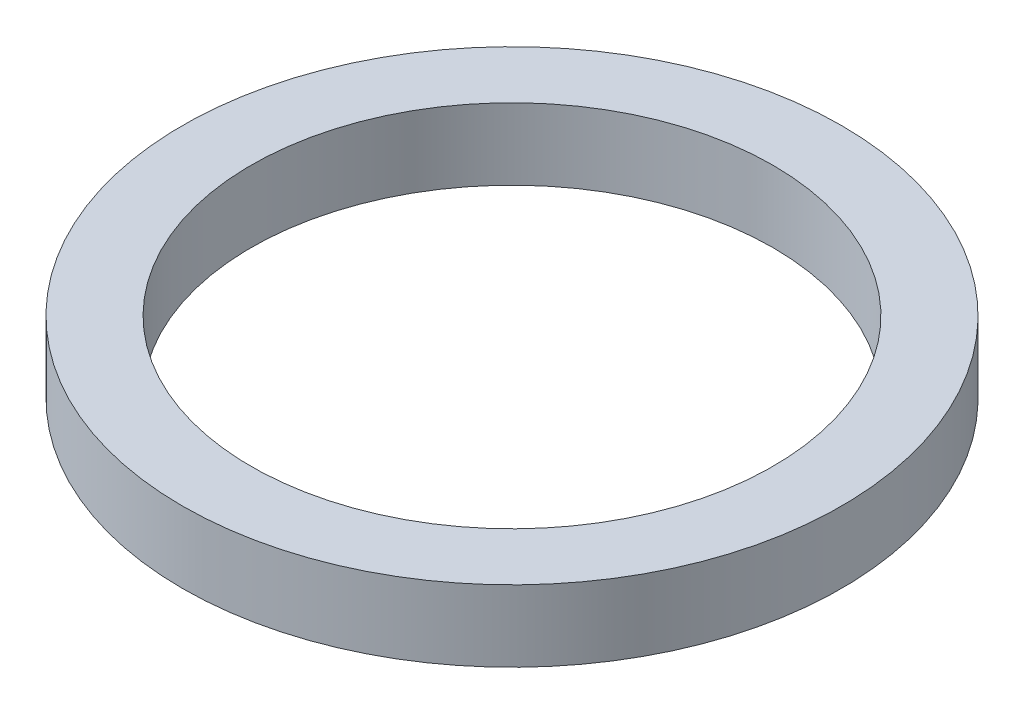
ISO-10303-21;
HEADER;
FILE_DESCRIPTION(('STEP AP214'),'2;1');
FILE_NAME('part.step','',(''),(''),'','','');
FILE_SCHEMA(('AUTOMOTIVE_DESIGN { 1 0 10303 214 1 1 1 1 }'));
ENDSEC;
DATA;
#1=APPLICATION_CONTEXT('core data for automotive mechanical design processes');
#2=APPLICATION_PROTOCOL_DEFINITION('international standard','automotive_design',2000,#1);
#3=PRODUCT_CONTEXT('',#1,'mechanical');
#4=PRODUCT('Part','Part','',(#3));
#5=PRODUCT_RELATED_PRODUCT_CATEGORY('part','',(#4));
#6=PRODUCT_DEFINITION_FORMATION('','',#4);
#7=PRODUCT_DEFINITION_CONTEXT('part definition',#1,'design');
#8=PRODUCT_DEFINITION('design','',#6,#7);
#9=PRODUCT_DEFINITION_SHAPE('','',#8);
#10=(LENGTH_UNIT() NAMED_UNIT(*) SI_UNIT(.MILLI.,.METRE.));
#11=(NAMED_UNIT(*) PLANE_ANGLE_UNIT() SI_UNIT($,.RADIAN.));
#12=(NAMED_UNIT(*) SI_UNIT($,.STERADIAN.) SOLID_ANGLE_UNIT());
#13=UNCERTAINTY_MEASURE_WITH_UNIT(LENGTH_MEASURE(1.E-05),#10,'distance_accuracy_value','');
#14=(GEOMETRIC_REPRESENTATION_CONTEXT(3) GLOBAL_UNCERTAINTY_ASSIGNED_CONTEXT((#13)) GLOBAL_UNIT_ASSIGNED_CONTEXT((#10,
#11,#12)) REPRESENTATION_CONTEXT('',''));
#15=CARTESIAN_POINT('',(0.,0.,0.));
#16=DIRECTION('',(0.,0.,1.));
#17=DIRECTION('',(1.,0.,0.));
#18=AXIS2_PLACEMENT_3D('',#15,#16,#17);
#19=CARTESIAN_POINT('',(0.,13.,0.));
#20=DIRECTION('',(0.,-1.,0.));
#21=DIRECTION('',(0.,0.,-1.));
#22=AXIS2_PLACEMENT_3D('',#19,#20,#21);
#23=CYLINDRICAL_SURFACE('',#22,60.);
#24=CARTESIAN_POINT('',(0.,13.,0.));
#25=DIRECTION('',(0.,1.,0.));
#26=DIRECTION('',(0.,0.,1.));
#27=AXIS2_PLACEMENT_3D('',#24,#25,#26);
#28=CIRCLE('',#27,60.);
#29=CARTESIAN_POINT('',(0.,13.,-60.));
#30=VERTEX_POINT('',#29);
#31=EDGE_CURVE('E10',#30,#30,#28,.T.);
#32=CARTESIAN_POINT('',(0.,0.,0.));
#33=DIRECTION('',(0.,1.,0.));
#34=DIRECTION('',(0.,0.,1.));
#35=AXIS2_PLACEMENT_3D('',#32,#33,#34);
#36=CIRCLE('',#35,60.);
#37=CARTESIAN_POINT('',(0.,0.,-60.));
#38=VERTEX_POINT('',#37);
#39=EDGE_CURVE('E37',#38,#38,#36,.T.);
#40=CARTESIAN_POINT('',(0.,13.,-60.));
#41=CARTESIAN_POINT('',(0.,12.8645833333333,-60.));
#42=CARTESIAN_POINT('',(0.,12.7291666666667,-60.));
#43=CARTESIAN_POINT('',(0.,12.4583333333333,-60.));
#44=CARTESIAN_POINT('',(0.,12.3229166666667,-60.));
#45=CARTESIAN_POINT('',(0.,12.0520833333333,-60.));
#46=CARTESIAN_POINT('',(0.,11.9166666666667,-60.));
#47=CARTESIAN_POINT('',(0.,11.6458333333333,-60.));
#48=CARTESIAN_POINT('',(0.,11.5104166666667,-60.));
#49=CARTESIAN_POINT('',(0.,11.2395833333333,-60.));
#50=CARTESIAN_POINT('',(0.,11.1041666666667,-60.));
#51=CARTESIAN_POINT('',(0.,10.8333333333333,-60.));
#52=CARTESIAN_POINT('',(0.,10.6979166666667,-60.));
#53=CARTESIAN_POINT('',(0.,10.4270833333333,-60.));
#54=CARTESIAN_POINT('',(0.,10.2916666666667,-60.));
#55=CARTESIAN_POINT('',(0.,10.0208333333333,-60.));
#56=CARTESIAN_POINT('',(0.,9.88541666666667,-60.));
#57=CARTESIAN_POINT('',(0.,9.61458333333333,-60.));
#58=CARTESIAN_POINT('',(0.,9.47916666666667,-60.));
#59=CARTESIAN_POINT('',(0.,9.20833333333333,-60.));
#60=CARTESIAN_POINT('',(0.,9.07291666666666,-60.));
#61=CARTESIAN_POINT('',(0.,8.80208333333333,-60.));
#62=CARTESIAN_POINT('',(0.,8.66666666666667,-60.));
#63=CARTESIAN_POINT('',(0.,8.39583333333333,-60.));
#64=CARTESIAN_POINT('',(0.,8.26041666666667,-60.));
#65=CARTESIAN_POINT('',(0.,7.98958333333333,-60.));
#66=CARTESIAN_POINT('',(0.,7.85416666666667,-60.));
#67=CARTESIAN_POINT('',(0.,7.58333333333333,-60.));
#68=CARTESIAN_POINT('',(0.,7.44791666666667,-60.));
#69=CARTESIAN_POINT('',(0.,7.17708333333333,-60.));
#70=CARTESIAN_POINT('',(0.,7.04166666666667,-60.));
#71=CARTESIAN_POINT('',(0.,6.77083333333333,-60.));
#72=CARTESIAN_POINT('',(0.,6.63541666666667,-60.));
#73=CARTESIAN_POINT('',(0.,6.36458333333333,-60.));
#74=CARTESIAN_POINT('',(0.,6.22916666666667,-60.));
#75=CARTESIAN_POINT('',(0.,5.95833333333333,-60.));
#76=CARTESIAN_POINT('',(0.,5.82291666666667,-60.));
#77=CARTESIAN_POINT('',(0.,5.55208333333333,-60.));
#78=CARTESIAN_POINT('',(0.,5.41666666666667,-60.));
#79=CARTESIAN_POINT('',(0.,5.14583333333333,-60.));
#80=CARTESIAN_POINT('',(0.,5.01041666666667,-60.));
#81=CARTESIAN_POINT('',(0.,4.73958333333333,-60.));
#82=CARTESIAN_POINT('',(0.,4.60416666666667,-60.));
#83=CARTESIAN_POINT('',(0.,4.33333333333333,-60.));
#84=CARTESIAN_POINT('',(0.,4.19791666666667,-60.));
#85=CARTESIAN_POINT('',(0.,3.92708333333333,-60.));
#86=CARTESIAN_POINT('',(0.,3.79166666666667,-60.));
#87=CARTESIAN_POINT('',(0.,3.52083333333333,-60.));
#88=CARTESIAN_POINT('',(0.,3.38541666666667,-60.));
#89=CARTESIAN_POINT('',(0.,3.11458333333333,-60.));
#90=CARTESIAN_POINT('',(0.,2.97916666666667,-60.));
#91=CARTESIAN_POINT('',(0.,2.70833333333333,-60.));
#92=CARTESIAN_POINT('',(0.,2.57291666666667,-60.));
#93=CARTESIAN_POINT('',(0.,2.30208333333333,-60.));
#94=CARTESIAN_POINT('',(0.,2.16666666666667,-60.));
#95=CARTESIAN_POINT('',(0.,1.89583333333333,-60.));
#96=CARTESIAN_POINT('',(0.,1.76041666666667,-60.));
#97=CARTESIAN_POINT('',(0.,1.48958333333333,-60.));
#98=CARTESIAN_POINT('',(0.,1.35416666666667,-60.));
#99=CARTESIAN_POINT('',(0.,1.08333333333333,-60.));
#100=CARTESIAN_POINT('',(0.,0.947916666666667,-60.));
#101=CARTESIAN_POINT('',(0.,0.677083333333334,-60.));
#102=CARTESIAN_POINT('',(0.,0.541666666666667,-60.));
#103=CARTESIAN_POINT('',(0.,0.270833333333334,-60.));
#104=CARTESIAN_POINT('',(0.,0.135416666666667,-60.));
#105=CARTESIAN_POINT('',(0.,0.,-60.));
#106=B_SPLINE_CURVE_WITH_KNOTS('',3,(#40,#41,#42,#43,#44,#45,#46,#47,#48,#49,#50,#51,#52,#53,
#54,#55,#56,#57,#58,#59,#60,#61,#62,#63,#64,#65,#66,#67,#68,#69,#70,#71,#72,#73,#74,#75,#76,#77,
#78,#79,#80,#81,#82,#83,#84,#85,#86,#87,#88,#89,#90,#91,#92,#93,#94,#95,#96,#97,#98,#99,#100,
#101,#102,#103,#104,#105),.UNSPECIFIED.,.F.,.F.,(4,2,2,2,2,2,2,2,2,2,2,2,2,2,2,2,2,2,2,2,2,2,2,
2,2,2,2,2,2,2,2,2,4),(0.,0.40625,0.812500000000001,1.21875,1.625,2.03125,2.4375,2.84375,3.25,
3.65625,4.0625,4.46875,4.875,5.28125,5.6875,6.09375,6.5,6.90625,7.3125,7.71875,8.125,8.53125,
8.9375,9.34375,9.75,10.15625,10.5625,10.96875,11.375,11.78125,12.1875,12.59375,13.),.UNSPECIFIED.);
#107=EDGE_CURVE('BSEAM40',#30,#38,#106,.T.);
#108=ORIENTED_EDGE('',*,*,#31,.F.);
#109=ORIENTED_EDGE('',*,*,#39,.T.);
#110=ORIENTED_EDGE('',*,*,#107,.T.);
#111=ORIENTED_EDGE('',*,*,#107,.F.);
#112=EDGE_LOOP('',(#108,#110,#109,#111));
#113=FACE_BOUND('',#112,.T.);
#114=ADVANCED_FACE('F40',(#113),#23,.T.);
#115=CARTESIAN_POINT('',(0.,13.,0.));
#116=DIRECTION('',(0.,1.,0.));
#117=DIRECTION('',(0.,0.,1.));
#118=AXIS2_PLACEMENT_3D('',#115,#116,#117);
#119=PLANE('',#118);
#120=CARTESIAN_POINT('',(0.,13.,0.));
#121=DIRECTION('',(0.,1.,0.));
#122=DIRECTION('',(0.,0.,1.));
#123=AXIS2_PLACEMENT_3D('',#120,#121,#122);
#124=CIRCLE('',#123,47.5);
#125=CARTESIAN_POINT('',(0.,13.,-47.5));
#126=VERTEX_POINT('',#125);
#127=EDGE_CURVE('E50',#126,#126,#124,.T.);
#128=ORIENTED_EDGE('',*,*,#127,.F.);
#129=EDGE_LOOP('',(#128));
#130=FACE_BOUND('',#129,.T.);
#131=ORIENTED_EDGE('',*,*,#31,.T.);
#132=EDGE_LOOP('',(#131));
#133=FACE_BOUND('',#132,.T.);
#134=ADVANCED_FACE('F59',(#130,#133),#119,.T.);
#135=CARTESIAN_POINT('',(0.,0.,0.));
#136=DIRECTION('',(0.,1.,0.));
#137=DIRECTION('',(0.,0.,1.));
#138=AXIS2_PLACEMENT_3D('',#135,#136,#137);
#139=PLANE('',#138);
#140=CARTESIAN_POINT('',(0.,0.,0.));
#141=DIRECTION('',(0.,1.,0.));
#142=DIRECTION('',(0.,0.,1.));
#143=AXIS2_PLACEMENT_3D('',#140,#141,#142);
#144=CIRCLE('',#143,47.5);
#145=CARTESIAN_POINT('',(0.,0.,-47.5));
#146=VERTEX_POINT('',#145);
#147=EDGE_CURVE('E47',#146,#146,#144,.T.);
#148=ORIENTED_EDGE('',*,*,#147,.T.);
#149=EDGE_LOOP('',(#148));
#150=FACE_BOUND('',#149,.T.);
#151=ORIENTED_EDGE('',*,*,#39,.F.);
#152=EDGE_LOOP('',(#151));
#153=FACE_BOUND('',#152,.T.);
#154=ADVANCED_FACE('F58',(#150,#153),#139,.F.);
#155=CARTESIAN_POINT('',(0.,13.,0.));
#156=DIRECTION('',(0.,-1.,0.));
#157=DIRECTION('',(0.,0.,-1.));
#158=AXIS2_PLACEMENT_3D('',#155,#156,#157);
#159=CYLINDRICAL_SURFACE('',#158,47.5);
#160=CARTESIAN_POINT('',(0.,13.,-47.5));
#161=CARTESIAN_POINT('',(0.,12.8645833333333,-47.5));
#162=CARTESIAN_POINT('',(0.,12.7291666666667,-47.5));
#163=CARTESIAN_POINT('',(0.,12.4583333333333,-47.5));
#164=CARTESIAN_POINT('',(0.,12.3229166666667,-47.5));
#165=CARTESIAN_POINT('',(0.,12.0520833333333,-47.5));
#166=CARTESIAN_POINT('',(0.,11.9166666666667,-47.5));
#167=CARTESIAN_POINT('',(0.,11.6458333333333,-47.5));
#168=CARTESIAN_POINT('',(0.,11.5104166666667,-47.5));
#169=CARTESIAN_POINT('',(0.,11.2395833333333,-47.5));
#170=CARTESIAN_POINT('',(0.,11.1041666666667,-47.5));
#171=CARTESIAN_POINT('',(0.,10.8333333333333,-47.5));
#172=CARTESIAN_POINT('',(0.,10.6979166666667,-47.5));
#173=CARTESIAN_POINT('',(0.,10.4270833333333,-47.5));
#174=CARTESIAN_POINT('',(0.,10.2916666666667,-47.5));
#175=CARTESIAN_POINT('',(0.,10.0208333333333,-47.5));
#176=CARTESIAN_POINT('',(0.,9.88541666666667,-47.5));
#177=CARTESIAN_POINT('',(0.,9.61458333333333,-47.5));
#178=CARTESIAN_POINT('',(0.,9.47916666666667,-47.5));
#179=CARTESIAN_POINT('',(0.,9.20833333333333,-47.5));
#180=CARTESIAN_POINT('',(0.,9.07291666666666,-47.5));
#181=CARTESIAN_POINT('',(0.,8.80208333333333,-47.5));
#182=CARTESIAN_POINT('',(0.,8.66666666666667,-47.5));
#183=CARTESIAN_POINT('',(0.,8.39583333333333,-47.5));
#184=CARTESIAN_POINT('',(0.,8.26041666666667,-47.5));
#185=CARTESIAN_POINT('',(0.,7.98958333333333,-47.5));
#186=CARTESIAN_POINT('',(0.,7.85416666666667,-47.5));
#187=CARTESIAN_POINT('',(0.,7.58333333333333,-47.5));
#188=CARTESIAN_POINT('',(0.,7.44791666666667,-47.5));
#189=CARTESIAN_POINT('',(0.,7.17708333333333,-47.5));
#190=CARTESIAN_POINT('',(0.,7.04166666666667,-47.5));
#191=CARTESIAN_POINT('',(0.,6.77083333333333,-47.5));
#192=CARTESIAN_POINT('',(0.,6.63541666666667,-47.5));
#193=CARTESIAN_POINT('',(0.,6.36458333333333,-47.5));
#194=CARTESIAN_POINT('',(0.,6.22916666666667,-47.5));
#195=CARTESIAN_POINT('',(0.,5.95833333333333,-47.5));
#196=CARTESIAN_POINT('',(0.,5.82291666666667,-47.5));
#197=CARTESIAN_POINT('',(0.,5.55208333333333,-47.5));
#198=CARTESIAN_POINT('',(0.,5.41666666666667,-47.5));
#199=CARTESIAN_POINT('',(0.,5.14583333333333,-47.5));
#200=CARTESIAN_POINT('',(0.,5.01041666666667,-47.5));
#201=CARTESIAN_POINT('',(0.,4.73958333333333,-47.5));
#202=CARTESIAN_POINT('',(0.,4.60416666666667,-47.5));
#203=CARTESIAN_POINT('',(0.,4.33333333333333,-47.5));
#204=CARTESIAN_POINT('',(0.,4.19791666666667,-47.5));
#205=CARTESIAN_POINT('',(0.,3.92708333333333,-47.5));
#206=CARTESIAN_POINT('',(0.,3.79166666666667,-47.5));
#207=CARTESIAN_POINT('',(0.,3.52083333333333,-47.5));
#208=CARTESIAN_POINT('',(0.,3.38541666666667,-47.5));
#209=CARTESIAN_POINT('',(0.,3.11458333333333,-47.5));
#210=CARTESIAN_POINT('',(0.,2.97916666666667,-47.5));
#211=CARTESIAN_POINT('',(0.,2.70833333333333,-47.5));
#212=CARTESIAN_POINT('',(0.,2.57291666666667,-47.5));
#213=CARTESIAN_POINT('',(0.,2.30208333333333,-47.5));
#214=CARTESIAN_POINT('',(0.,2.16666666666667,-47.5));
#215=CARTESIAN_POINT('',(0.,1.89583333333333,-47.5));
#216=CARTESIAN_POINT('',(0.,1.76041666666667,-47.5));
#217=CARTESIAN_POINT('',(0.,1.48958333333333,-47.5));
#218=CARTESIAN_POINT('',(0.,1.35416666666667,-47.5));
#219=CARTESIAN_POINT('',(0.,1.08333333333333,-47.5));
#220=CARTESIAN_POINT('',(0.,0.947916666666667,-47.5));
#221=CARTESIAN_POINT('',(0.,0.677083333333334,-47.5));
#222=CARTESIAN_POINT('',(0.,0.541666666666667,-47.5));
#223=CARTESIAN_POINT('',(0.,0.270833333333334,-47.5));
#224=CARTESIAN_POINT('',(0.,0.135416666666667,-47.5));
#225=CARTESIAN_POINT('',(0.,0.,-47.5));
#226=B_SPLINE_CURVE_WITH_KNOTS('',3,(#160,#161,#162,#163,#164,#165,#166,#167,#168,#169,#170,
#171,#172,#173,#174,#175,#176,#177,#178,#179,#180,#181,#182,#183,#184,#185,#186,#187,#188,#189,
#190,#191,#192,#193,#194,#195,#196,#197,#198,#199,#200,#201,#202,#203,#204,#205,#206,#207,#208,
#209,#210,#211,#212,#213,#214,#215,#216,#217,#218,#219,#220,#221,#222,#223,#224,#225),
.UNSPECIFIED.,.F.,.F.,(4,2,2,2,2,2,2,2,2,2,2,2,2,2,2,2,2,2,2,2,2,2,2,2,2,2,2,2,2,2,2,2,4),(0.,
0.40625,0.812500000000001,1.21875,1.625,2.03125,2.4375,2.84375,3.25,3.65625,4.0625,4.46875,
4.875,5.28125,5.6875,6.09375,6.5,6.90625,7.3125,7.71875,8.125,8.53125,8.9375,9.34375,9.75,
10.15625,10.5625,10.96875,11.375,11.78125,12.1875,12.59375,13.),.UNSPECIFIED.);
#227=EDGE_CURVE('BSEAM54',#126,#146,#226,.T.);
#228=ORIENTED_EDGE('',*,*,#127,.T.);
#229=ORIENTED_EDGE('',*,*,#147,.F.);
#230=ORIENTED_EDGE('',*,*,#227,.T.);
#231=ORIENTED_EDGE('',*,*,#227,.F.);
#232=EDGE_LOOP('',(#228,#230,#229,#231));
#233=FACE_BOUND('',#232,.T.);
#234=ADVANCED_FACE('F54',(#233),#159,.F.);
#235=CLOSED_SHELL('',(#114,#134,#154,#234));
#236=MANIFOLD_SOLID_BREP('B2',#235);
#237=ADVANCED_BREP_SHAPE_REPRESENTATION('',(#18,#236),#14);
#238=SHAPE_DEFINITION_REPRESENTATION(#9,#237);
ENDSEC;
END-ISO-10303-21;
